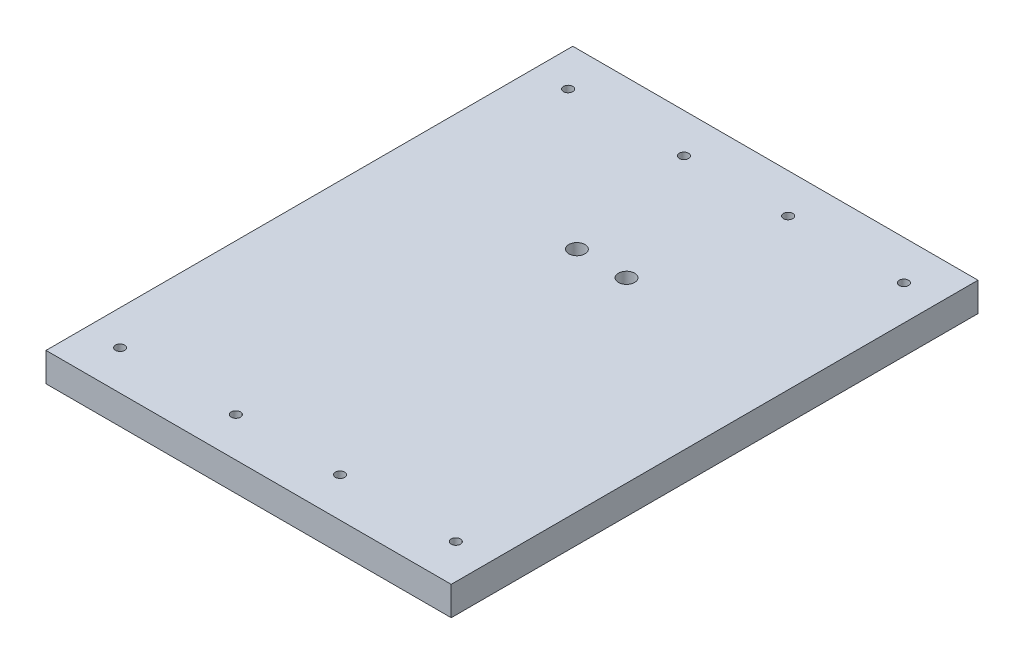
ISO-10303-21;
HEADER;
FILE_DESCRIPTION(('STEP AP214'),'2;1');
FILE_NAME('part.step','',(''),(''),'','','');
FILE_SCHEMA(('AUTOMOTIVE_DESIGN { 1 0 10303 214 1 1 1 1 }'));
ENDSEC;
DATA;
#1=APPLICATION_CONTEXT('core data for automotive mechanical design processes');
#2=APPLICATION_PROTOCOL_DEFINITION('international standard','automotive_design',2000,#1);
#3=PRODUCT_CONTEXT('',#1,'mechanical');
#4=PRODUCT('Part','Part','',(#3));
#5=PRODUCT_RELATED_PRODUCT_CATEGORY('part','',(#4));
#6=PRODUCT_DEFINITION_FORMATION('','',#4);
#7=PRODUCT_DEFINITION_CONTEXT('part definition',#1,'design');
#8=PRODUCT_DEFINITION('design','',#6,#7);
#9=PRODUCT_DEFINITION_SHAPE('','',#8);
#10=(LENGTH_UNIT() NAMED_UNIT(*) SI_UNIT(.MILLI.,.METRE.));
#11=(NAMED_UNIT(*) PLANE_ANGLE_UNIT() SI_UNIT($,.RADIAN.));
#12=(NAMED_UNIT(*) SI_UNIT($,.STERADIAN.) SOLID_ANGLE_UNIT());
#13=UNCERTAINTY_MEASURE_WITH_UNIT(LENGTH_MEASURE(1.E-05),#10,'distance_accuracy_value','');
#14=(GEOMETRIC_REPRESENTATION_CONTEXT(3) GLOBAL_UNCERTAINTY_ASSIGNED_CONTEXT((#13)) GLOBAL_UNIT_ASSIGNED_CONTEXT((#10,
#11,#12)) REPRESENTATION_CONTEXT('',''));
#15=CARTESIAN_POINT('',(0.,0.,0.));
#16=DIRECTION('',(0.,0.,1.));
#17=DIRECTION('',(1.,0.,0.));
#18=AXIS2_PLACEMENT_3D('',#15,#16,#17);
#19=CARTESIAN_POINT('',(44.45,6.35,57.785));
#20=DIRECTION('',(-1.,0.,0.));
#21=DIRECTION('',(0.,0.,1.));
#22=AXIS2_PLACEMENT_3D('',#19,#20,#21);
#23=PLANE('',#22);
#24=DIRECTION('',(0.,0.,-1.));
#25=VECTOR('',#24,1.);
#26=CARTESIAN_POINT('',(44.45,0.,57.785));
#27=LINE('',#26,#25);
#28=CARTESIAN_POINT('',(44.45,0.,57.785));
#29=VERTEX_POINT('',#28);
#30=CARTESIAN_POINT('',(44.45,0.,-57.785));
#31=VERTEX_POINT('',#30);
#32=EDGE_CURVE('E97',#29,#31,#27,.T.);
#33=ORIENTED_EDGE('',*,*,#32,.T.);
#34=DIRECTION('',(0.,-1.,0.));
#35=VECTOR('',#34,1.);
#36=CARTESIAN_POINT('',(44.45,6.35,-57.785));
#37=LINE('',#36,#35);
#38=CARTESIAN_POINT('',(44.45,6.35,-57.785));
#39=VERTEX_POINT('',#38);
#40=EDGE_CURVE('E11',#39,#31,#37,.T.);
#41=ORIENTED_EDGE('',*,*,#40,.F.);
#42=DIRECTION('',(0.,0.,-1.));
#43=VECTOR('',#42,1.);
#44=CARTESIAN_POINT('',(44.45,6.35,57.785));
#45=LINE('',#44,#43);
#46=CARTESIAN_POINT('',(44.45,6.35,57.785));
#47=VERTEX_POINT('',#46);
#48=EDGE_CURVE('E85',#47,#39,#45,.T.);
#49=ORIENTED_EDGE('',*,*,#48,.F.);
#50=DIRECTION('',(0.,-1.,0.));
#51=VECTOR('',#50,1.);
#52=CARTESIAN_POINT('',(44.45,6.35,57.785));
#53=LINE('',#52,#51);
#54=EDGE_CURVE('E93',#47,#29,#53,.T.);
#55=ORIENTED_EDGE('',*,*,#54,.T.);
#56=EDGE_LOOP('',(#33,#41,#49,#55));
#57=FACE_BOUND('',#56,.T.);
#58=ADVANCED_FACE('F34',(#57),#23,.F.);
#59=CARTESIAN_POINT('',(-44.45,6.35,-57.785));
#60=DIRECTION('',(0.,0.,1.));
#61=DIRECTION('',(1.,0.,0.));
#62=AXIS2_PLACEMENT_3D('',#59,#60,#61);
#63=PLANE('',#62);
#64=DIRECTION('',(-1.,0.,0.));
#65=VECTOR('',#64,1.);
#66=CARTESIAN_POINT('',(-44.45,0.,-57.785));
#67=LINE('',#66,#65);
#68=CARTESIAN_POINT('',(-44.45,0.,-57.785));
#69=VERTEX_POINT('',#68);
#70=EDGE_CURVE('E89',#31,#69,#67,.T.);
#71=ORIENTED_EDGE('',*,*,#70,.T.);
#72=DIRECTION('',(0.,-1.,0.));
#73=VECTOR('',#72,1.);
#74=CARTESIAN_POINT('',(-44.45,6.35,-57.785));
#75=LINE('',#74,#73);
#76=CARTESIAN_POINT('',(-44.45,6.35,-57.785));
#77=VERTEX_POINT('',#76);
#78=EDGE_CURVE('E42',#77,#69,#75,.T.);
#79=ORIENTED_EDGE('',*,*,#78,.F.);
#80=DIRECTION('',(-1.,0.,0.));
#81=VECTOR('',#80,1.);
#82=CARTESIAN_POINT('',(-44.45,6.35,-57.785));
#83=LINE('',#82,#81);
#84=EDGE_CURVE('E80',#39,#77,#83,.T.);
#85=ORIENTED_EDGE('',*,*,#84,.F.);
#86=ORIENTED_EDGE('',*,*,#40,.T.);
#87=EDGE_LOOP('',(#71,#79,#85,#86));
#88=FACE_BOUND('',#87,.T.);
#89=ADVANCED_FACE('F88',(#88),#63,.F.);
#90=CARTESIAN_POINT('',(-44.45,6.35,57.785));
#91=DIRECTION('',(1.,0.,0.));
#92=DIRECTION('',(0.,0.,-1.));
#93=AXIS2_PLACEMENT_3D('',#90,#91,#92);
#94=PLANE('',#93);
#95=DIRECTION('',(0.,0.,1.));
#96=VECTOR('',#95,1.);
#97=CARTESIAN_POINT('',(-44.45,0.,57.785));
#98=LINE('',#97,#96);
#99=CARTESIAN_POINT('',(-44.45,0.,57.785));
#100=VERTEX_POINT('',#99);
#101=EDGE_CURVE('E67',#69,#100,#98,.T.);
#102=ORIENTED_EDGE('',*,*,#101,.T.);
#103=DIRECTION('',(0.,-1.,0.));
#104=VECTOR('',#103,1.);
#105=CARTESIAN_POINT('',(-44.45,6.35,57.785));
#106=LINE('',#105,#104);
#107=CARTESIAN_POINT('',(-44.45,6.35,57.785));
#108=VERTEX_POINT('',#107);
#109=EDGE_CURVE('E90',#108,#100,#106,.T.);
#110=ORIENTED_EDGE('',*,*,#109,.F.);
#111=DIRECTION('',(0.,0.,1.));
#112=VECTOR('',#111,1.);
#113=CARTESIAN_POINT('',(-44.45,6.35,57.785));
#114=LINE('',#113,#112);
#115=EDGE_CURVE('E83',#77,#108,#114,.T.);
#116=ORIENTED_EDGE('',*,*,#115,.F.);
#117=ORIENTED_EDGE('',*,*,#78,.T.);
#118=EDGE_LOOP('',(#102,#110,#116,#117));
#119=FACE_BOUND('',#118,.T.);
#120=ADVANCED_FACE('F91',(#119),#94,.F.);
#121=CARTESIAN_POINT('',(-44.45,6.35,57.785));
#122=DIRECTION('',(0.,0.,-1.));
#123=DIRECTION('',(-1.,0.,0.));
#124=AXIS2_PLACEMENT_3D('',#121,#122,#123);
#125=PLANE('',#124);
#126=DIRECTION('',(1.,0.,0.));
#127=VECTOR('',#126,1.);
#128=CARTESIAN_POINT('',(-44.45,0.,57.785));
#129=LINE('',#128,#127);
#130=EDGE_CURVE('E73',#100,#29,#129,.T.);
#131=ORIENTED_EDGE('',*,*,#130,.T.);
#132=ORIENTED_EDGE('',*,*,#54,.F.);
#133=DIRECTION('',(1.,0.,0.));
#134=VECTOR('',#133,1.);
#135=CARTESIAN_POINT('',(-44.45,6.35,57.785));
#136=LINE('',#135,#134);
#137=EDGE_CURVE('E50',#108,#47,#136,.T.);
#138=ORIENTED_EDGE('',*,*,#137,.F.);
#139=ORIENTED_EDGE('',*,*,#109,.T.);
#140=EDGE_LOOP('',(#131,#132,#138,#139));
#141=FACE_BOUND('',#140,.T.);
#142=ADVANCED_FACE('F105',(#141),#125,.F.);
#143=CARTESIAN_POINT('',(0.,6.35,0.));
#144=DIRECTION('',(0.,-1.,0.));
#145=DIRECTION('',(0.,0.,-1.));
#146=AXIS2_PLACEMENT_3D('',#143,#144,#145);
#147=PLANE('',#146);
#148=CARTESIAN_POINT('',(5.445,6.35,-19.685));
#149=DIRECTION('',(0.,1.,0.));
#150=DIRECTION('',(0.,0.,-1.));
#151=AXIS2_PLACEMENT_3D('',#148,#149,#150);
#152=CIRCLE('',#151,1.778);
#153=CARTESIAN_POINT('',(5.445,6.35,-21.463));
#154=VERTEX_POINT('',#153);
#155=EDGE_CURVE('E165',#154,#154,#152,.T.);
#156=ORIENTED_EDGE('',*,*,#155,.F.);
#157=EDGE_LOOP('',(#156));
#158=FACE_BOUND('',#157,.T.);
#159=CARTESIAN_POINT('',(-5.44499999999999,6.35,-19.685));
#160=DIRECTION('',(0.,1.,0.));
#161=DIRECTION('',(0.,0.,1.));
#162=AXIS2_PLACEMENT_3D('',#159,#160,#161);
#163=CIRCLE('',#162,1.778);
#164=CARTESIAN_POINT('',(-5.44499999999999,6.35,-17.907));
#165=VERTEX_POINT('',#164);
#166=EDGE_CURVE('E159',#165,#165,#163,.T.);
#167=ORIENTED_EDGE('',*,*,#166,.F.);
#168=EDGE_LOOP('',(#167));
#169=FACE_BOUND('',#168,.T.);
#170=CARTESIAN_POINT('',(-36.83,6.35,49.149));
#171=DIRECTION('',(0.,1.,0.));
#172=DIRECTION('',(0.,0.,-1.));
#173=AXIS2_PLACEMENT_3D('',#170,#171,#172);
#174=CIRCLE('',#173,1.016);
#175=CARTESIAN_POINT('',(-36.83,6.35,48.133));
#176=VERTEX_POINT('',#175);
#177=EDGE_CURVE('E153',#176,#176,#174,.T.);
#178=ORIENTED_EDGE('',*,*,#177,.F.);
#179=EDGE_LOOP('',(#178));
#180=FACE_BOUND('',#179,.T.);
#181=CARTESIAN_POINT('',(11.43,6.35,49.149));
#182=DIRECTION('',(0.,1.,0.));
#183=DIRECTION('',(0.,0.,-1.));
#184=AXIS2_PLACEMENT_3D('',#181,#182,#183);
#185=CIRCLE('',#184,1.016);
#186=CARTESIAN_POINT('',(11.43,6.35,48.133));
#187=VERTEX_POINT('',#186);
#188=EDGE_CURVE('E147',#187,#187,#185,.T.);
#189=ORIENTED_EDGE('',*,*,#188,.F.);
#190=EDGE_LOOP('',(#189));
#191=FACE_BOUND('',#190,.T.);
#192=CARTESIAN_POINT('',(-11.43,6.35,49.149));
#193=DIRECTION('',(0.,1.,0.));
#194=DIRECTION('',(0.,0.,-1.));
#195=AXIS2_PLACEMENT_3D('',#192,#193,#194);
#196=CIRCLE('',#195,1.016);
#197=CARTESIAN_POINT('',(-11.43,6.35,48.133));
#198=VERTEX_POINT('',#197);
#199=EDGE_CURVE('E141',#198,#198,#196,.T.);
#200=ORIENTED_EDGE('',*,*,#199,.F.);
#201=EDGE_LOOP('',(#200));
#202=FACE_BOUND('',#201,.T.);
#203=CARTESIAN_POINT('',(36.83,6.35,49.149));
#204=DIRECTION('',(0.,1.,0.));
#205=DIRECTION('',(0.,0.,-1.));
#206=AXIS2_PLACEMENT_3D('',#203,#204,#205);
#207=CIRCLE('',#206,1.016);
#208=CARTESIAN_POINT('',(36.83,6.35,48.133));
#209=VERTEX_POINT('',#208);
#210=EDGE_CURVE('E135',#209,#209,#207,.T.);
#211=ORIENTED_EDGE('',*,*,#210,.F.);
#212=EDGE_LOOP('',(#211));
#213=FACE_BOUND('',#212,.T.);
#214=CARTESIAN_POINT('',(36.83,6.35,-49.149));
#215=DIRECTION('',(0.,1.,0.));
#216=DIRECTION('',(0.,0.,1.));
#217=AXIS2_PLACEMENT_3D('',#214,#215,#216);
#218=CIRCLE('',#217,1.016);
#219=CARTESIAN_POINT('',(36.83,6.35,-48.133));
#220=VERTEX_POINT('',#219);
#221=EDGE_CURVE('E129',#220,#220,#218,.T.);
#222=ORIENTED_EDGE('',*,*,#221,.F.);
#223=EDGE_LOOP('',(#222));
#224=FACE_BOUND('',#223,.T.);
#225=CARTESIAN_POINT('',(11.43,6.35,-49.149));
#226=DIRECTION('',(0.,1.,0.));
#227=DIRECTION('',(0.,0.,1.));
#228=AXIS2_PLACEMENT_3D('',#225,#226,#227);
#229=CIRCLE('',#228,1.016);
#230=CARTESIAN_POINT('',(11.43,6.35,-48.133));
#231=VERTEX_POINT('',#230);
#232=EDGE_CURVE('E123',#231,#231,#229,.T.);
#233=ORIENTED_EDGE('',*,*,#232,.F.);
#234=EDGE_LOOP('',(#233));
#235=FACE_BOUND('',#234,.T.);
#236=CARTESIAN_POINT('',(-11.43,6.35,-49.149));
#237=DIRECTION('',(0.,1.,0.));
#238=DIRECTION('',(0.,0.,1.));
#239=AXIS2_PLACEMENT_3D('',#236,#237,#238);
#240=CIRCLE('',#239,1.016);
#241=CARTESIAN_POINT('',(-11.43,6.35,-48.133));
#242=VERTEX_POINT('',#241);
#243=EDGE_CURVE('E117',#242,#242,#240,.T.);
#244=ORIENTED_EDGE('',*,*,#243,.F.);
#245=EDGE_LOOP('',(#244));
#246=FACE_BOUND('',#245,.T.);
#247=CARTESIAN_POINT('',(-36.83,6.35,-49.149));
#248=DIRECTION('',(0.,1.,0.));
#249=DIRECTION('',(0.,0.,1.));
#250=AXIS2_PLACEMENT_3D('',#247,#248,#249);
#251=CIRCLE('',#250,1.016);
#252=CARTESIAN_POINT('',(-36.83,6.35,-48.133));
#253=VERTEX_POINT('',#252);
#254=EDGE_CURVE('E111',#253,#253,#251,.T.);
#255=ORIENTED_EDGE('',*,*,#254,.F.);
#256=EDGE_LOOP('',(#255));
#257=FACE_BOUND('',#256,.T.);
#258=ORIENTED_EDGE('',*,*,#48,.T.);
#259=ORIENTED_EDGE('',*,*,#84,.T.);
#260=ORIENTED_EDGE('',*,*,#115,.T.);
#261=ORIENTED_EDGE('',*,*,#137,.T.);
#262=EDGE_LOOP('',(#258,#259,#260,#261));
#263=FACE_BOUND('',#262,.T.);
#264=ADVANCED_FACE('F81',(#158,#169,#180,#191,#202,#213,#224,#235,#246,#257,#263),#147,.F.);
#265=CARTESIAN_POINT('',(0.,0.,0.));
#266=DIRECTION('',(0.,-1.,0.));
#267=DIRECTION('',(0.,0.,-1.));
#268=AXIS2_PLACEMENT_3D('',#265,#266,#267);
#269=PLANE('',#268);
#270=CARTESIAN_POINT('',(5.445,0.,-19.685));
#271=DIRECTION('',(0.,1.,0.));
#272=DIRECTION('',(0.,0.,-1.));
#273=AXIS2_PLACEMENT_3D('',#270,#271,#272);
#274=CIRCLE('',#273,1.778);
#275=CARTESIAN_POINT('',(5.445,0.,-21.463));
#276=VERTEX_POINT('',#275);
#277=EDGE_CURVE('E162',#276,#276,#274,.T.);
#278=ORIENTED_EDGE('',*,*,#277,.T.);
#279=EDGE_LOOP('',(#278));
#280=FACE_BOUND('',#279,.T.);
#281=CARTESIAN_POINT('',(-5.44499999999999,0.,-19.685));
#282=DIRECTION('',(0.,1.,0.));
#283=DIRECTION('',(0.,0.,1.));
#284=AXIS2_PLACEMENT_3D('',#281,#282,#283);
#285=CIRCLE('',#284,1.778);
#286=CARTESIAN_POINT('',(-5.44499999999999,0.,-17.907));
#287=VERTEX_POINT('',#286);
#288=EDGE_CURVE('E156',#287,#287,#285,.T.);
#289=ORIENTED_EDGE('',*,*,#288,.T.);
#290=EDGE_LOOP('',(#289));
#291=FACE_BOUND('',#290,.T.);
#292=CARTESIAN_POINT('',(-36.83,0.,49.149));
#293=DIRECTION('',(0.,1.,0.));
#294=DIRECTION('',(0.,0.,-1.));
#295=AXIS2_PLACEMENT_3D('',#292,#293,#294);
#296=CIRCLE('',#295,1.016);
#297=CARTESIAN_POINT('',(-36.83,0.,48.133));
#298=VERTEX_POINT('',#297);
#299=EDGE_CURVE('E150',#298,#298,#296,.T.);
#300=ORIENTED_EDGE('',*,*,#299,.T.);
#301=EDGE_LOOP('',(#300));
#302=FACE_BOUND('',#301,.T.);
#303=CARTESIAN_POINT('',(11.43,0.,49.149));
#304=DIRECTION('',(0.,1.,0.));
#305=DIRECTION('',(0.,0.,-1.));
#306=AXIS2_PLACEMENT_3D('',#303,#304,#305);
#307=CIRCLE('',#306,1.016);
#308=CARTESIAN_POINT('',(11.43,0.,48.133));
#309=VERTEX_POINT('',#308);
#310=EDGE_CURVE('E144',#309,#309,#307,.T.);
#311=ORIENTED_EDGE('',*,*,#310,.T.);
#312=EDGE_LOOP('',(#311));
#313=FACE_BOUND('',#312,.T.);
#314=CARTESIAN_POINT('',(-11.43,0.,49.149));
#315=DIRECTION('',(0.,1.,0.));
#316=DIRECTION('',(0.,0.,-1.));
#317=AXIS2_PLACEMENT_3D('',#314,#315,#316);
#318=CIRCLE('',#317,1.016);
#319=CARTESIAN_POINT('',(-11.43,0.,48.133));
#320=VERTEX_POINT('',#319);
#321=EDGE_CURVE('E138',#320,#320,#318,.T.);
#322=ORIENTED_EDGE('',*,*,#321,.T.);
#323=EDGE_LOOP('',(#322));
#324=FACE_BOUND('',#323,.T.);
#325=CARTESIAN_POINT('',(36.83,0.,49.149));
#326=DIRECTION('',(0.,1.,0.));
#327=DIRECTION('',(0.,0.,-1.));
#328=AXIS2_PLACEMENT_3D('',#325,#326,#327);
#329=CIRCLE('',#328,1.016);
#330=CARTESIAN_POINT('',(36.83,0.,48.133));
#331=VERTEX_POINT('',#330);
#332=EDGE_CURVE('E132',#331,#331,#329,.T.);
#333=ORIENTED_EDGE('',*,*,#332,.T.);
#334=EDGE_LOOP('',(#333));
#335=FACE_BOUND('',#334,.T.);
#336=CARTESIAN_POINT('',(36.83,0.,-49.149));
#337=DIRECTION('',(0.,1.,0.));
#338=DIRECTION('',(0.,0.,1.));
#339=AXIS2_PLACEMENT_3D('',#336,#337,#338);
#340=CIRCLE('',#339,1.016);
#341=CARTESIAN_POINT('',(36.83,0.,-48.133));
#342=VERTEX_POINT('',#341);
#343=EDGE_CURVE('E126',#342,#342,#340,.T.);
#344=ORIENTED_EDGE('',*,*,#343,.T.);
#345=EDGE_LOOP('',(#344));
#346=FACE_BOUND('',#345,.T.);
#347=CARTESIAN_POINT('',(11.43,0.,-49.149));
#348=DIRECTION('',(0.,1.,0.));
#349=DIRECTION('',(0.,0.,1.));
#350=AXIS2_PLACEMENT_3D('',#347,#348,#349);
#351=CIRCLE('',#350,1.016);
#352=CARTESIAN_POINT('',(11.43,0.,-48.133));
#353=VERTEX_POINT('',#352);
#354=EDGE_CURVE('E120',#353,#353,#351,.T.);
#355=ORIENTED_EDGE('',*,*,#354,.T.);
#356=EDGE_LOOP('',(#355));
#357=FACE_BOUND('',#356,.T.);
#358=CARTESIAN_POINT('',(-11.43,0.,-49.149));
#359=DIRECTION('',(0.,1.,0.));
#360=DIRECTION('',(0.,0.,1.));
#361=AXIS2_PLACEMENT_3D('',#358,#359,#360);
#362=CIRCLE('',#361,1.016);
#363=CARTESIAN_POINT('',(-11.43,0.,-48.133));
#364=VERTEX_POINT('',#363);
#365=EDGE_CURVE('E114',#364,#364,#362,.T.);
#366=ORIENTED_EDGE('',*,*,#365,.T.);
#367=EDGE_LOOP('',(#366));
#368=FACE_BOUND('',#367,.T.);
#369=CARTESIAN_POINT('',(-36.83,0.,-49.149));
#370=DIRECTION('',(0.,1.,0.));
#371=DIRECTION('',(0.,0.,1.));
#372=AXIS2_PLACEMENT_3D('',#369,#370,#371);
#373=CIRCLE('',#372,1.016);
#374=CARTESIAN_POINT('',(-36.83,0.,-48.133));
#375=VERTEX_POINT('',#374);
#376=EDGE_CURVE('E100',#375,#375,#373,.T.);
#377=ORIENTED_EDGE('',*,*,#376,.T.);
#378=EDGE_LOOP('',(#377));
#379=FACE_BOUND('',#378,.T.);
#380=ORIENTED_EDGE('',*,*,#32,.F.);
#381=ORIENTED_EDGE('',*,*,#130,.F.);
#382=ORIENTED_EDGE('',*,*,#101,.F.);
#383=ORIENTED_EDGE('',*,*,#70,.F.);
#384=EDGE_LOOP('',(#380,#381,#382,#383));
#385=FACE_BOUND('',#384,.T.);
#386=ADVANCED_FACE('F108',(#280,#291,#302,#313,#324,#335,#346,#357,#368,#379,#385),#269,.T.);
#387=CARTESIAN_POINT('',(-36.83,0.,-49.149));
#388=DIRECTION('',(0.,1.,0.));
#389=DIRECTION('',(0.,0.,1.));
#390=AXIS2_PLACEMENT_3D('',#387,#388,#389);
#391=CYLINDRICAL_SURFACE('',#390,1.016);
#392=ORIENTED_EDGE('',*,*,#376,.F.);
#393=EDGE_LOOP('',(#392));
#394=FACE_BOUND('',#393,.T.);
#395=ORIENTED_EDGE('',*,*,#254,.T.);
#396=EDGE_LOOP('',(#395));
#397=FACE_BOUND('',#396,.T.);
#398=ADVANCED_FACE('F201',(#394,#397),#391,.F.);
#399=CARTESIAN_POINT('',(-11.43,0.,-49.149));
#400=DIRECTION('',(0.,1.,0.));
#401=DIRECTION('',(0.,0.,1.));
#402=AXIS2_PLACEMENT_3D('',#399,#400,#401);
#403=CYLINDRICAL_SURFACE('',#402,1.016);
#404=ORIENTED_EDGE('',*,*,#365,.F.);
#405=EDGE_LOOP('',(#404));
#406=FACE_BOUND('',#405,.T.);
#407=ORIENTED_EDGE('',*,*,#243,.T.);
#408=EDGE_LOOP('',(#407));
#409=FACE_BOUND('',#408,.T.);
#410=ADVANCED_FACE('F203',(#406,#409),#403,.F.);
#411=CARTESIAN_POINT('',(11.43,0.,-49.149));
#412=DIRECTION('',(0.,1.,0.));
#413=DIRECTION('',(0.,0.,1.));
#414=AXIS2_PLACEMENT_3D('',#411,#412,#413);
#415=CYLINDRICAL_SURFACE('',#414,1.016);
#416=ORIENTED_EDGE('',*,*,#354,.F.);
#417=EDGE_LOOP('',(#416));
#418=FACE_BOUND('',#417,.T.);
#419=ORIENTED_EDGE('',*,*,#232,.T.);
#420=EDGE_LOOP('',(#419));
#421=FACE_BOUND('',#420,.T.);
#422=ADVANCED_FACE('F210',(#418,#421),#415,.F.);
#423=CARTESIAN_POINT('',(36.83,0.,-49.149));
#424=DIRECTION('',(0.,1.,0.));
#425=DIRECTION('',(0.,0.,1.));
#426=AXIS2_PLACEMENT_3D('',#423,#424,#425);
#427=CYLINDRICAL_SURFACE('',#426,1.016);
#428=ORIENTED_EDGE('',*,*,#343,.F.);
#429=EDGE_LOOP('',(#428));
#430=FACE_BOUND('',#429,.T.);
#431=ORIENTED_EDGE('',*,*,#221,.T.);
#432=EDGE_LOOP('',(#431));
#433=FACE_BOUND('',#432,.T.);
#434=ADVANCED_FACE('F286',(#430,#433),#427,.F.);
#435=CARTESIAN_POINT('',(36.83,0.,49.149));
#436=DIRECTION('',(0.,1.,0.));
#437=DIRECTION('',(0.,0.,1.));
#438=AXIS2_PLACEMENT_3D('',#435,#436,#437);
#439=CYLINDRICAL_SURFACE('',#438,1.016);
#440=ORIENTED_EDGE('',*,*,#332,.F.);
#441=EDGE_LOOP('',(#440));
#442=FACE_BOUND('',#441,.T.);
#443=ORIENTED_EDGE('',*,*,#210,.T.);
#444=EDGE_LOOP('',(#443));
#445=FACE_BOUND('',#444,.T.);
#446=ADVANCED_FACE('F278',(#442,#445),#439,.F.);
#447=CARTESIAN_POINT('',(-11.43,0.,49.149));
#448=DIRECTION('',(0.,1.,0.));
#449=DIRECTION('',(0.,0.,1.));
#450=AXIS2_PLACEMENT_3D('',#447,#448,#449);
#451=CYLINDRICAL_SURFACE('',#450,1.016);
#452=ORIENTED_EDGE('',*,*,#321,.F.);
#453=EDGE_LOOP('',(#452));
#454=FACE_BOUND('',#453,.T.);
#455=ORIENTED_EDGE('',*,*,#199,.T.);
#456=EDGE_LOOP('',(#455));
#457=FACE_BOUND('',#456,.T.);
#458=ADVANCED_FACE('F270',(#454,#457),#451,.F.);
#459=CARTESIAN_POINT('',(11.43,0.,49.149));
#460=DIRECTION('',(0.,1.,0.));
#461=DIRECTION('',(0.,0.,1.));
#462=AXIS2_PLACEMENT_3D('',#459,#460,#461);
#463=CYLINDRICAL_SURFACE('',#462,1.016);
#464=ORIENTED_EDGE('',*,*,#310,.F.);
#465=EDGE_LOOP('',(#464));
#466=FACE_BOUND('',#465,.T.);
#467=ORIENTED_EDGE('',*,*,#188,.T.);
#468=EDGE_LOOP('',(#467));
#469=FACE_BOUND('',#468,.T.);
#470=ADVANCED_FACE('F263',(#466,#469),#463,.F.);
#471=CARTESIAN_POINT('',(-36.83,0.,49.149));
#472=DIRECTION('',(0.,1.,0.));
#473=DIRECTION('',(0.,0.,1.));
#474=AXIS2_PLACEMENT_3D('',#471,#472,#473);
#475=CYLINDRICAL_SURFACE('',#474,1.016);
#476=ORIENTED_EDGE('',*,*,#299,.F.);
#477=EDGE_LOOP('',(#476));
#478=FACE_BOUND('',#477,.T.);
#479=ORIENTED_EDGE('',*,*,#177,.T.);
#480=EDGE_LOOP('',(#479));
#481=FACE_BOUND('',#480,.T.);
#482=ADVANCED_FACE('F248',(#478,#481),#475,.F.);
#483=CARTESIAN_POINT('',(-5.44499999999999,0.,-19.685));
#484=DIRECTION('',(0.,1.,0.));
#485=DIRECTION('',(0.,0.,1.));
#486=AXIS2_PLACEMENT_3D('',#483,#484,#485);
#487=CYLINDRICAL_SURFACE('',#486,1.778);
#488=ORIENTED_EDGE('',*,*,#288,.F.);
#489=EDGE_LOOP('',(#488));
#490=FACE_BOUND('',#489,.T.);
#491=ORIENTED_EDGE('',*,*,#166,.T.);
#492=EDGE_LOOP('',(#491));
#493=FACE_BOUND('',#492,.T.);
#494=ADVANCED_FACE('F176',(#490,#493),#487,.F.);
#495=CARTESIAN_POINT('',(5.445,0.,-19.685));
#496=DIRECTION('',(0.,1.,0.));
#497=DIRECTION('',(0.,0.,1.));
#498=AXIS2_PLACEMENT_3D('',#495,#496,#497);
#499=CYLINDRICAL_SURFACE('',#498,1.778);
#500=ORIENTED_EDGE('',*,*,#277,.F.);
#501=EDGE_LOOP('',(#500));
#502=FACE_BOUND('',#501,.T.);
#503=ORIENTED_EDGE('',*,*,#155,.T.);
#504=EDGE_LOOP('',(#503));
#505=FACE_BOUND('',#504,.T.);
#506=ADVANCED_FACE('F173',(#502,#505),#499,.F.);
#507=CLOSED_SHELL('',(#58,#89,#120,#142,#264,#386,#398,#410,#422,#434,#446,#458,#470,#482,#494,#506));
#508=MANIFOLD_SOLID_BREP('B2',#507);
#509=ADVANCED_BREP_SHAPE_REPRESENTATION('',(#18,#508),#14);
#510=SHAPE_DEFINITION_REPRESENTATION(#9,#509);
ENDSEC;
END-ISO-10303-21;
